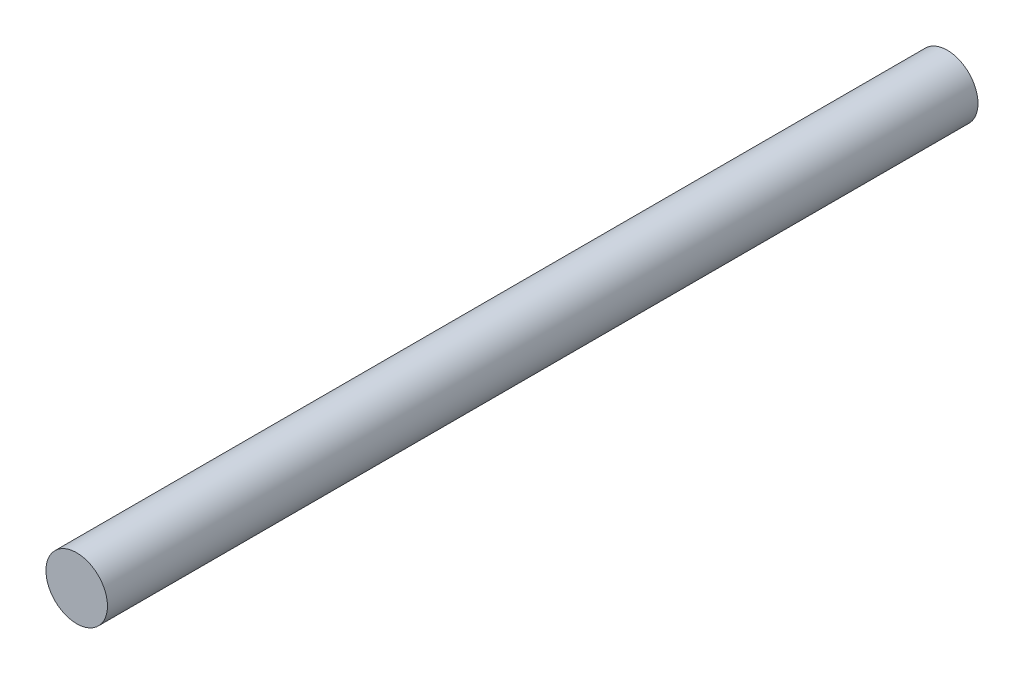
ISO-10303-21;
HEADER;
FILE_DESCRIPTION(('STEP AP214'),'2;1');
FILE_NAME('part.step','',(''),(''),'','','');
FILE_SCHEMA(('AUTOMOTIVE_DESIGN { 1 0 10303 214 1 1 1 1 }'));
ENDSEC;
DATA;
#1=APPLICATION_CONTEXT('core data for automotive mechanical design processes');
#2=APPLICATION_PROTOCOL_DEFINITION('international standard','automotive_design',2000,#1);
#3=PRODUCT_CONTEXT('',#1,'mechanical');
#4=PRODUCT('Part','Part','',(#3));
#5=PRODUCT_RELATED_PRODUCT_CATEGORY('part','',(#4));
#6=PRODUCT_DEFINITION_FORMATION('','',#4);
#7=PRODUCT_DEFINITION_CONTEXT('part definition',#1,'design');
#8=PRODUCT_DEFINITION('design','',#6,#7);
#9=PRODUCT_DEFINITION_SHAPE('','',#8);
#10=(LENGTH_UNIT() NAMED_UNIT(*) SI_UNIT(.MILLI.,.METRE.));
#11=(NAMED_UNIT(*) PLANE_ANGLE_UNIT() SI_UNIT($,.RADIAN.));
#12=(NAMED_UNIT(*) SI_UNIT($,.STERADIAN.) SOLID_ANGLE_UNIT());
#13=UNCERTAINTY_MEASURE_WITH_UNIT(LENGTH_MEASURE(1.E-05),#10,'distance_accuracy_value','');
#14=(GEOMETRIC_REPRESENTATION_CONTEXT(3) GLOBAL_UNCERTAINTY_ASSIGNED_CONTEXT((#13)) GLOBAL_UNIT_ASSIGNED_CONTEXT((#10,
#11,#12)) REPRESENTATION_CONTEXT('',''));
#15=CARTESIAN_POINT('',(0.,0.,0.));
#16=DIRECTION('',(0.,0.,1.));
#17=DIRECTION('',(1.,0.,0.));
#18=AXIS2_PLACEMENT_3D('',#15,#16,#17);
#19=CARTESIAN_POINT('',(0.,0.,450.));
#20=DIRECTION('',(0.,0.,-1.));
#21=DIRECTION('',(-1.,0.,0.));
#22=AXIS2_PLACEMENT_3D('',#19,#20,#21);
#23=CYLINDRICAL_SURFACE('',#22,15.9);
#24=CARTESIAN_POINT('',(0.,0.,450.));
#25=DIRECTION('',(0.,0.,1.));
#26=DIRECTION('',(1.,0.,0.));
#27=AXIS2_PLACEMENT_3D('',#24,#25,#26);
#28=CIRCLE('',#27,15.9);
#29=CARTESIAN_POINT('',(15.9,0.,450.));
#30=VERTEX_POINT('',#29);
#31=EDGE_CURVE('E10',#30,#30,#28,.T.);
#32=ORIENTED_EDGE('',*,*,#31,.F.);
#33=EDGE_LOOP('',(#32));
#34=FACE_BOUND('',#33,.T.);
#35=CARTESIAN_POINT('',(0.,0.,0.));
#36=DIRECTION('',(0.,0.,1.));
#37=DIRECTION('',(1.,0.,0.));
#38=AXIS2_PLACEMENT_3D('',#35,#36,#37);
#39=CIRCLE('',#38,15.9);
#40=CARTESIAN_POINT('',(15.9,0.,0.));
#41=VERTEX_POINT('',#40);
#42=EDGE_CURVE('E32',#41,#41,#39,.T.);
#43=ORIENTED_EDGE('',*,*,#42,.T.);
#44=EDGE_LOOP('',(#43));
#45=FACE_BOUND('',#44,.T.);
#46=ADVANCED_FACE('F29',(#34,#45),#23,.T.);
#47=CARTESIAN_POINT('',(0.,0.,450.));
#48=DIRECTION('',(0.,0.,1.));
#49=DIRECTION('',(1.,0.,0.));
#50=AXIS2_PLACEMENT_3D('',#47,#48,#49);
#51=PLANE('',#50);
#52=ORIENTED_EDGE('',*,*,#31,.T.);
#53=EDGE_LOOP('',(#52));
#54=FACE_BOUND('',#53,.T.);
#55=ADVANCED_FACE('F44',(#54),#51,.T.);
#56=CARTESIAN_POINT('',(0.,0.,0.));
#57=DIRECTION('',(0.,0.,1.));
#58=DIRECTION('',(1.,0.,0.));
#59=AXIS2_PLACEMENT_3D('',#56,#57,#58);
#60=PLANE('',#59);
#61=ORIENTED_EDGE('',*,*,#42,.F.);
#62=EDGE_LOOP('',(#61));
#63=FACE_BOUND('',#62,.T.);
#64=ADVANCED_FACE('F42',(#63),#60,.F.);
#65=CLOSED_SHELL('',(#46,#55,#64));
#66=MANIFOLD_SOLID_BREP('B2',#65);
#67=ADVANCED_BREP_SHAPE_REPRESENTATION('',(#18,#66),#14);
#68=SHAPE_DEFINITION_REPRESENTATION(#9,#67);
ENDSEC;
END-ISO-10303-21;
